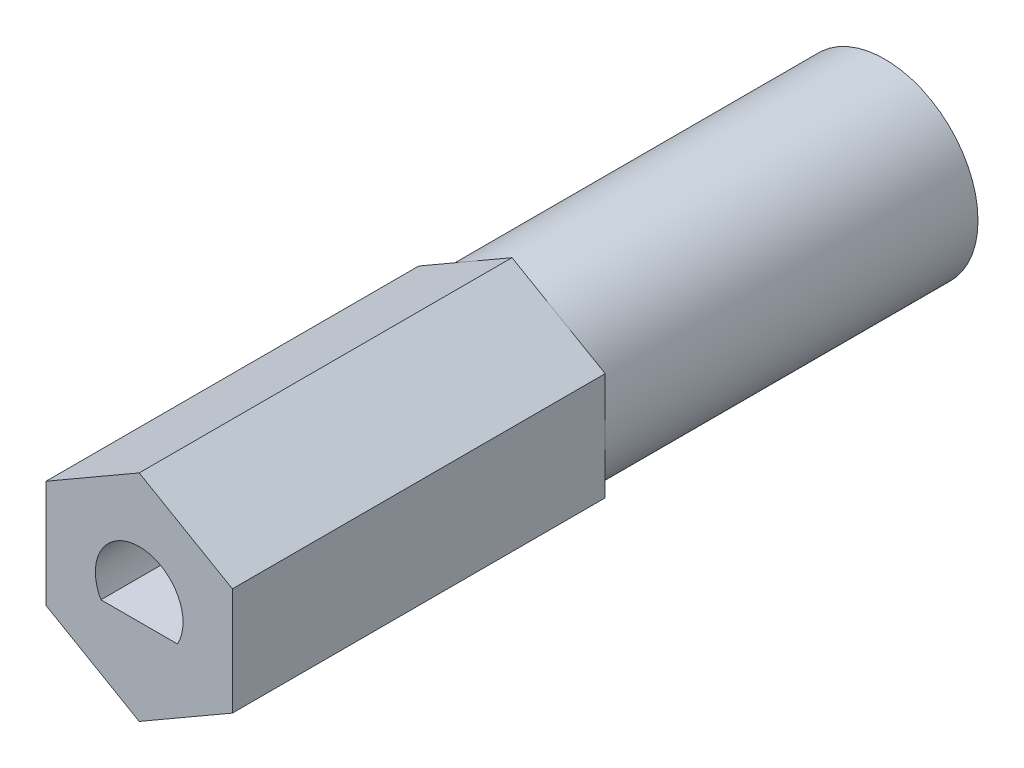
ISO-10303-21;
HEADER;
FILE_DESCRIPTION(('STEP AP214'),'2;1');
FILE_NAME('part.step','',(''),(''),'','','');
FILE_SCHEMA(('AUTOMOTIVE_DESIGN { 1 0 10303 214 1 1 1 1 }'));
ENDSEC;
DATA;
#1=APPLICATION_CONTEXT('core data for automotive mechanical design processes');
#2=APPLICATION_PROTOCOL_DEFINITION('international standard','automotive_design',2000,#1);
#3=PRODUCT_CONTEXT('',#1,'mechanical');
#4=PRODUCT('Part','Part','',(#3));
#5=PRODUCT_RELATED_PRODUCT_CATEGORY('part','',(#4));
#6=PRODUCT_DEFINITION_FORMATION('','',#4);
#7=PRODUCT_DEFINITION_CONTEXT('part definition',#1,'design');
#8=PRODUCT_DEFINITION('design','',#6,#7);
#9=PRODUCT_DEFINITION_SHAPE('','',#8);
#10=(LENGTH_UNIT() NAMED_UNIT(*) SI_UNIT(.MILLI.,.METRE.));
#11=(NAMED_UNIT(*) PLANE_ANGLE_UNIT() SI_UNIT($,.RADIAN.));
#12=(NAMED_UNIT(*) SI_UNIT($,.STERADIAN.) SOLID_ANGLE_UNIT());
#13=UNCERTAINTY_MEASURE_WITH_UNIT(LENGTH_MEASURE(1.E-05),#10,'distance_accuracy_value','');
#14=(GEOMETRIC_REPRESENTATION_CONTEXT(3) GLOBAL_UNCERTAINTY_ASSIGNED_CONTEXT((#13)) GLOBAL_UNIT_ASSIGNED_CONTEXT((#10,
#11,#12)) REPRESENTATION_CONTEXT('',''));
#15=CARTESIAN_POINT('',(0.,0.,0.));
#16=DIRECTION('',(0.,0.,1.));
#17=DIRECTION('',(1.,0.,0.));
#18=AXIS2_PLACEMENT_3D('',#15,#16,#17);
#19=CARTESIAN_POINT('',(3.175,1.83308710467706,-25.4));
#20=DIRECTION('',(0.5,0.866025403784439,0.));
#21=DIRECTION('',(-0.866025403784439,0.5,0.));
#22=AXIS2_PLACEMENT_3D('',#19,#20,#21);
#23=PLANE('',#22);
#24=DIRECTION('',(0.866025403784439,-0.5,0.));
#25=VECTOR('',#24,1.);
#26=CARTESIAN_POINT('',(3.175,1.83308710467706,-12.7));
#27=LINE('',#26,#25);
#28=CARTESIAN_POINT('',(0.,3.66617420935412,-12.7));
#29=VERTEX_POINT('',#28);
#30=CARTESIAN_POINT('',(1.5875,2.74963065701559,-12.7));
#31=VERTEX_POINT('',#30);
#32=EDGE_CURVE('E150',#29,#31,#27,.T.);
#33=ORIENTED_EDGE('',*,*,#32,.F.);
#34=DIRECTION('',(0.,0.,1.));
#35=VECTOR('',#34,1.);
#36=CARTESIAN_POINT('',(0.,3.66617420935412,-25.4));
#37=LINE('',#36,#35);
#38=CARTESIAN_POINT('',(0.,3.66617420935412,0.));
#39=VERTEX_POINT('',#38);
#40=EDGE_CURVE('E183',#29,#39,#37,.T.);
#41=ORIENTED_EDGE('',*,*,#40,.T.);
#42=DIRECTION('',(-0.866025403784439,0.5,0.));
#43=VECTOR('',#42,1.);
#44=CARTESIAN_POINT('',(3.175,1.83308710467706,0.));
#45=LINE('',#44,#43);
#46=CARTESIAN_POINT('',(3.175,1.83308710467706,0.));
#47=VERTEX_POINT('',#46);
#48=EDGE_CURVE('E164',#47,#39,#45,.T.);
#49=ORIENTED_EDGE('',*,*,#48,.F.);
#50=DIRECTION('',(0.,0.,1.));
#51=VECTOR('',#50,1.);
#52=CARTESIAN_POINT('',(3.175,1.83308710467706,-25.4));
#53=LINE('',#52,#51);
#54=CARTESIAN_POINT('',(3.175,1.83308710467706,-12.7));
#55=VERTEX_POINT('',#54);
#56=EDGE_CURVE('E184',#55,#47,#53,.T.);
#57=ORIENTED_EDGE('',*,*,#56,.F.);
#58=EDGE_CURVE('E121',#31,#55,#27,.T.);
#59=ORIENTED_EDGE('',*,*,#58,.F.);
#60=EDGE_LOOP('',(#33,#41,#49,#57,#59));
#61=FACE_BOUND('',#60,.T.);
#62=ADVANCED_FACE('F33',(#61),#23,.T.);
#63=CARTESIAN_POINT('',(3.175,-1.83308710467706,-25.4));
#64=DIRECTION('',(1.,0.,0.));
#65=DIRECTION('',(0.,1.,0.));
#66=AXIS2_PLACEMENT_3D('',#63,#64,#65);
#67=PLANE('',#66);
#68=DIRECTION('',(0.,-1.,0.));
#69=VECTOR('',#68,1.);
#70=CARTESIAN_POINT('',(3.175,-1.83308710467706,-12.7));
#71=LINE('',#70,#69);
#72=CARTESIAN_POINT('',(3.175,0.,-12.7));
#73=VERTEX_POINT('',#72);
#74=EDGE_CURVE('E115',#55,#73,#71,.T.);
#75=ORIENTED_EDGE('',*,*,#74,.F.);
#76=ORIENTED_EDGE('',*,*,#56,.T.);
#77=DIRECTION('',(0.,1.,0.));
#78=VECTOR('',#77,1.);
#79=CARTESIAN_POINT('',(3.175,-1.83308710467706,0.));
#80=LINE('',#79,#78);
#81=CARTESIAN_POINT('',(3.175,-1.83308710467706,0.));
#82=VERTEX_POINT('',#81);
#83=EDGE_CURVE('E180',#82,#47,#80,.T.);
#84=ORIENTED_EDGE('',*,*,#83,.F.);
#85=DIRECTION('',(0.,0.,1.));
#86=VECTOR('',#85,1.);
#87=CARTESIAN_POINT('',(3.175,-1.83308710467706,-25.4));
#88=LINE('',#87,#86);
#89=CARTESIAN_POINT('',(3.175,-1.83308710467706,-12.7));
#90=VERTEX_POINT('',#89);
#91=EDGE_CURVE('E144',#90,#82,#88,.T.);
#92=ORIENTED_EDGE('',*,*,#91,.F.);
#93=EDGE_CURVE('E125',#73,#90,#71,.T.);
#94=ORIENTED_EDGE('',*,*,#93,.F.);
#95=EDGE_LOOP('',(#75,#76,#84,#92,#94));
#96=FACE_BOUND('',#95,.T.);
#97=ADVANCED_FACE('F142',(#96),#67,.T.);
#98=CARTESIAN_POINT('',(0.,-3.66617420935412,-25.4));
#99=DIRECTION('',(0.5,-0.866025403784438,0.));
#100=DIRECTION('',(0.866025403784439,0.5,0.));
#101=AXIS2_PLACEMENT_3D('',#98,#99,#100);
#102=PLANE('',#101);
#103=DIRECTION('',(-0.866025403784439,-0.5,0.));
#104=VECTOR('',#103,1.);
#105=CARTESIAN_POINT('',(0.,-3.66617420935412,-12.7));
#106=LINE('',#105,#104);
#107=CARTESIAN_POINT('',(1.5875,-2.74963065701559,-12.7));
#108=VERTEX_POINT('',#107);
#109=EDGE_CURVE('E132',#90,#108,#106,.T.);
#110=ORIENTED_EDGE('',*,*,#109,.F.);
#111=ORIENTED_EDGE('',*,*,#91,.T.);
#112=DIRECTION('',(0.866025403784439,0.5,0.));
#113=VECTOR('',#112,1.);
#114=CARTESIAN_POINT('',(0.,-3.66617420935412,0.));
#115=LINE('',#114,#113);
#116=CARTESIAN_POINT('',(0.,-3.66617420935412,0.));
#117=VERTEX_POINT('',#116);
#118=EDGE_CURVE('E177',#117,#82,#115,.T.);
#119=ORIENTED_EDGE('',*,*,#118,.F.);
#120=DIRECTION('',(0.,0.,1.));
#121=VECTOR('',#120,1.);
#122=CARTESIAN_POINT('',(0.,-3.66617420935412,-25.4));
#123=LINE('',#122,#121);
#124=CARTESIAN_POINT('',(0.,-3.66617420935412,-12.7));
#125=VERTEX_POINT('',#124);
#126=EDGE_CURVE('E188',#125,#117,#123,.T.);
#127=ORIENTED_EDGE('',*,*,#126,.F.);
#128=EDGE_CURVE('E145',#108,#125,#106,.T.);
#129=ORIENTED_EDGE('',*,*,#128,.F.);
#130=EDGE_LOOP('',(#110,#111,#119,#127,#129));
#131=FACE_BOUND('',#130,.T.);
#132=ADVANCED_FACE('F214',(#131),#102,.T.);
#133=CARTESIAN_POINT('',(-3.175,-1.83308710467706,-25.4));
#134=DIRECTION('',(-0.5,-0.866025403784439,0.));
#135=DIRECTION('',(0.866025403784439,-0.5,0.));
#136=AXIS2_PLACEMENT_3D('',#133,#134,#135);
#137=PLANE('',#136);
#138=DIRECTION('',(-0.866025403784439,0.5,0.));
#139=VECTOR('',#138,1.);
#140=CARTESIAN_POINT('',(-3.175,-1.83308710467706,-12.7));
#141=LINE('',#140,#139);
#142=CARTESIAN_POINT('',(-1.5875,-2.74963065701559,-12.7));
#143=VERTEX_POINT('',#142);
#144=EDGE_CURVE('E218',#125,#143,#141,.T.);
#145=ORIENTED_EDGE('',*,*,#144,.F.);
#146=ORIENTED_EDGE('',*,*,#126,.T.);
#147=DIRECTION('',(0.866025403784439,-0.5,0.));
#148=VECTOR('',#147,1.);
#149=CARTESIAN_POINT('',(-3.175,-1.83308710467706,0.));
#150=LINE('',#149,#148);
#151=CARTESIAN_POINT('',(-3.175,-1.83308710467706,0.));
#152=VERTEX_POINT('',#151);
#153=EDGE_CURVE('E174',#152,#117,#150,.T.);
#154=ORIENTED_EDGE('',*,*,#153,.F.);
#155=DIRECTION('',(0.,0.,1.));
#156=VECTOR('',#155,1.);
#157=CARTESIAN_POINT('',(-3.175,-1.83308710467706,-25.4));
#158=LINE('',#157,#156);
#159=CARTESIAN_POINT('',(-3.175,-1.83308710467706,-12.7));
#160=VERTEX_POINT('',#159);
#161=EDGE_CURVE('E190',#160,#152,#158,.T.);
#162=ORIENTED_EDGE('',*,*,#161,.F.);
#163=EDGE_CURVE('E219',#143,#160,#141,.T.);
#164=ORIENTED_EDGE('',*,*,#163,.F.);
#165=EDGE_LOOP('',(#145,#146,#154,#162,#164));
#166=FACE_BOUND('',#165,.T.);
#167=ADVANCED_FACE('F238',(#166),#137,.T.);
#168=CARTESIAN_POINT('',(-3.175,1.83308710467706,-25.4));
#169=DIRECTION('',(-1.,0.,0.));
#170=DIRECTION('',(0.,-1.,0.));
#171=AXIS2_PLACEMENT_3D('',#168,#169,#170);
#172=PLANE('',#171);
#173=DIRECTION('',(0.,1.,0.));
#174=VECTOR('',#173,1.);
#175=CARTESIAN_POINT('',(-3.175,1.83308710467706,-12.7));
#176=LINE('',#175,#174);
#177=CARTESIAN_POINT('',(-3.175,0.,-12.7));
#178=VERTEX_POINT('',#177);
#179=EDGE_CURVE('E220',#160,#178,#176,.T.);
#180=ORIENTED_EDGE('',*,*,#179,.F.);
#181=ORIENTED_EDGE('',*,*,#161,.T.);
#182=DIRECTION('',(0.,-1.,0.));
#183=VECTOR('',#182,1.);
#184=CARTESIAN_POINT('',(-3.175,1.83308710467706,0.));
#185=LINE('',#184,#183);
#186=CARTESIAN_POINT('',(-3.175,1.83308710467706,0.));
#187=VERTEX_POINT('',#186);
#188=EDGE_CURVE('E171',#187,#152,#185,.T.);
#189=ORIENTED_EDGE('',*,*,#188,.F.);
#190=DIRECTION('',(0.,0.,1.));
#191=VECTOR('',#190,1.);
#192=CARTESIAN_POINT('',(-3.175,1.83308710467706,-25.4));
#193=LINE('',#192,#191);
#194=CARTESIAN_POINT('',(-3.175,1.83308710467706,-12.7));
#195=VERTEX_POINT('',#194);
#196=EDGE_CURVE('E192',#195,#187,#193,.T.);
#197=ORIENTED_EDGE('',*,*,#196,.F.);
#198=EDGE_CURVE('E140',#178,#195,#176,.T.);
#199=ORIENTED_EDGE('',*,*,#198,.F.);
#200=EDGE_LOOP('',(#180,#181,#189,#197,#199));
#201=FACE_BOUND('',#200,.T.);
#202=ADVANCED_FACE('F236',(#201),#172,.T.);
#203=CARTESIAN_POINT('',(0.,3.66617420935412,-25.4));
#204=DIRECTION('',(-0.5,0.866025403784439,0.));
#205=DIRECTION('',(-0.866025403784439,-0.5,0.));
#206=AXIS2_PLACEMENT_3D('',#203,#204,#205);
#207=PLANE('',#206);
#208=DIRECTION('',(0.866025403784439,0.5,0.));
#209=VECTOR('',#208,1.);
#210=CARTESIAN_POINT('',(0.,3.66617420935412,-12.7));
#211=LINE('',#210,#209);
#212=CARTESIAN_POINT('',(-1.5875,2.74963065701559,-12.7));
#213=VERTEX_POINT('',#212);
#214=EDGE_CURVE('E12',#195,#213,#211,.T.);
#215=ORIENTED_EDGE('',*,*,#214,.F.);
#216=ORIENTED_EDGE('',*,*,#196,.T.);
#217=DIRECTION('',(-0.866025403784439,-0.5,0.));
#218=VECTOR('',#217,1.);
#219=CARTESIAN_POINT('',(0.,3.66617420935412,0.));
#220=LINE('',#219,#218);
#221=EDGE_CURVE('E168',#39,#187,#220,.T.);
#222=ORIENTED_EDGE('',*,*,#221,.F.);
#223=ORIENTED_EDGE('',*,*,#40,.F.);
#224=EDGE_CURVE('E36',#213,#29,#211,.T.);
#225=ORIENTED_EDGE('',*,*,#224,.F.);
#226=EDGE_LOOP('',(#215,#216,#222,#223,#225));
#227=FACE_BOUND('',#226,.T.);
#228=ADVANCED_FACE('F205',(#227),#207,.T.);
#229=CARTESIAN_POINT('',(0.,0.,0.));
#230=DIRECTION('',(0.,0.,1.));
#231=DIRECTION('',(1.,0.,0.));
#232=AXIS2_PLACEMENT_3D('',#229,#230,#231);
#233=PLANE('',#232);
#234=CARTESIAN_POINT('',(0.,0.,0.));
#235=DIRECTION('',(0.,0.,1.));
#236=DIRECTION('',(1.,0.,0.));
#237=AXIS2_PLACEMENT_3D('',#234,#235,#236);
#238=CIRCLE('',#237,1.49352);
#239=CARTESIAN_POINT('',(1.30352988074689,-0.72898,0.));
#240=VERTEX_POINT('',#239);
#241=CARTESIAN_POINT('',(-1.30352988074689,-0.72898,0.));
#242=VERTEX_POINT('',#241);
#243=EDGE_CURVE('E55',#240,#242,#238,.T.);
#244=ORIENTED_EDGE('',*,*,#243,.F.);
#245=DIRECTION('',(1.,0.,0.));
#246=VECTOR('',#245,1.);
#247=CARTESIAN_POINT('',(-1.30352988074689,-0.72898,0.));
#248=LINE('',#247,#246);
#249=EDGE_CURVE('E155',#242,#240,#248,.T.);
#250=ORIENTED_EDGE('',*,*,#249,.F.);
#251=EDGE_LOOP('',(#244,#250));
#252=FACE_BOUND('',#251,.T.);
#253=ORIENTED_EDGE('',*,*,#48,.T.);
#254=ORIENTED_EDGE('',*,*,#221,.T.);
#255=ORIENTED_EDGE('',*,*,#188,.T.);
#256=ORIENTED_EDGE('',*,*,#153,.T.);
#257=ORIENTED_EDGE('',*,*,#118,.T.);
#258=ORIENTED_EDGE('',*,*,#83,.T.);
#259=EDGE_LOOP('',(#253,#254,#255,#256,#257,#258));
#260=FACE_BOUND('',#259,.T.);
#261=ADVANCED_FACE('F209',(#252,#260),#233,.T.);
#262=CARTESIAN_POINT('',(0.,0.,-5.08));
#263=DIRECTION('',(0.,0.,1.));
#264=DIRECTION('',(1.,0.,0.));
#265=AXIS2_PLACEMENT_3D('',#262,#263,#264);
#266=CYLINDRICAL_SURFACE('',#265,1.49352);
#267=ORIENTED_EDGE('',*,*,#243,.T.);
#268=DIRECTION('',(0.,0.,1.));
#269=VECTOR('',#268,1.);
#270=CARTESIAN_POINT('',(-1.30352988074689,-0.72898,-5.08));
#271=LINE('',#270,#269);
#272=CARTESIAN_POINT('',(-1.30352988074689,-0.72898,-5.08));
#273=VERTEX_POINT('',#272);
#274=EDGE_CURVE('E158',#273,#242,#271,.T.);
#275=ORIENTED_EDGE('',*,*,#274,.F.);
#276=CARTESIAN_POINT('',(0.,0.,-5.08));
#277=DIRECTION('',(0.,0.,1.));
#278=DIRECTION('',(1.,0.,0.));
#279=AXIS2_PLACEMENT_3D('',#276,#277,#278);
#280=CIRCLE('',#279,1.49352);
#281=CARTESIAN_POINT('',(1.30352988074689,-0.72898,-5.08));
#282=VERTEX_POINT('',#281);
#283=EDGE_CURVE('E151',#282,#273,#280,.T.);
#284=ORIENTED_EDGE('',*,*,#283,.F.);
#285=DIRECTION('',(0.,0.,1.));
#286=VECTOR('',#285,1.);
#287=CARTESIAN_POINT('',(1.30352988074689,-0.72898,-5.08));
#288=LINE('',#287,#286);
#289=EDGE_CURVE('E162',#282,#240,#288,.T.);
#290=ORIENTED_EDGE('',*,*,#289,.T.);
#291=EDGE_LOOP('',(#267,#275,#284,#290));
#292=FACE_BOUND('',#291,.T.);
#293=ADVANCED_FACE('F257',(#292),#266,.F.);
#294=CARTESIAN_POINT('',(-1.30352988074689,-0.72898,-5.08));
#295=DIRECTION('',(0.,-1.,0.));
#296=DIRECTION('',(0.,0.,-1.));
#297=AXIS2_PLACEMENT_3D('',#294,#295,#296);
#298=PLANE('',#297);
#299=ORIENTED_EDGE('',*,*,#249,.T.);
#300=ORIENTED_EDGE('',*,*,#289,.F.);
#301=DIRECTION('',(1.,0.,0.));
#302=VECTOR('',#301,1.);
#303=CARTESIAN_POINT('',(-1.30352988074689,-0.72898,-5.08));
#304=LINE('',#303,#302);
#305=EDGE_CURVE('E154',#273,#282,#304,.T.);
#306=ORIENTED_EDGE('',*,*,#305,.F.);
#307=ORIENTED_EDGE('',*,*,#274,.T.);
#308=EDGE_LOOP('',(#299,#300,#306,#307));
#309=FACE_BOUND('',#308,.T.);
#310=ADVANCED_FACE('F265',(#309),#298,.F.);
#311=CARTESIAN_POINT('',(0.,0.,-5.08));
#312=DIRECTION('',(0.,0.,1.));
#313=DIRECTION('',(1.,0.,0.));
#314=AXIS2_PLACEMENT_3D('',#311,#312,#313);
#315=PLANE('',#314);
#316=ORIENTED_EDGE('',*,*,#283,.T.);
#317=ORIENTED_EDGE('',*,*,#305,.T.);
#318=EDGE_LOOP('',(#316,#317));
#319=FACE_BOUND('',#318,.T.);
#320=ADVANCED_FACE('F268',(#319),#315,.T.);
#321=CARTESIAN_POINT('',(0.,0.,-12.7));
#322=DIRECTION('',(0.,0.,1.));
#323=DIRECTION('',(1.,0.,0.));
#324=AXIS2_PLACEMENT_3D('',#321,#322,#323);
#325=PLANE('',#324);
#326=ORIENTED_EDGE('',*,*,#32,.T.);
#327=CARTESIAN_POINT('',(0.,0.,-12.7));
#328=DIRECTION('',(0.,0.,1.));
#329=DIRECTION('',(1.,0.,0.));
#330=AXIS2_PLACEMENT_3D('',#327,#328,#329);
#331=CIRCLE('',#330,3.175);
#332=EDGE_CURVE('E47',#31,#213,#331,.T.);
#333=ORIENTED_EDGE('',*,*,#332,.T.);
#334=ORIENTED_EDGE('',*,*,#224,.T.);
#335=EDGE_LOOP('',(#326,#333,#334));
#336=FACE_BOUND('',#335,.T.);
#337=ADVANCED_FACE('F198',(#336),#325,.F.);
#338=ORIENTED_EDGE('',*,*,#58,.T.);
#339=ORIENTED_EDGE('',*,*,#74,.T.);
#340=EDGE_CURVE('E119',#73,#31,#331,.T.);
#341=ORIENTED_EDGE('',*,*,#340,.T.);
#342=EDGE_LOOP('',(#338,#339,#341));
#343=FACE_BOUND('',#342,.T.);
#344=ADVANCED_FACE('F117',(#343),#325,.F.);
#345=ORIENTED_EDGE('',*,*,#93,.T.);
#346=ORIENTED_EDGE('',*,*,#109,.T.);
#347=EDGE_CURVE('E129',#108,#73,#331,.T.);
#348=ORIENTED_EDGE('',*,*,#347,.T.);
#349=EDGE_LOOP('',(#345,#346,#348));
#350=FACE_BOUND('',#349,.T.);
#351=ADVANCED_FACE('F130',(#350),#325,.F.);
#352=ORIENTED_EDGE('',*,*,#128,.T.);
#353=ORIENTED_EDGE('',*,*,#144,.T.);
#354=EDGE_CURVE('E136',#143,#108,#331,.T.);
#355=ORIENTED_EDGE('',*,*,#354,.T.);
#356=EDGE_LOOP('',(#352,#353,#355));
#357=FACE_BOUND('',#356,.T.);
#358=ADVANCED_FACE('F279',(#357),#325,.F.);
#359=ORIENTED_EDGE('',*,*,#163,.T.);
#360=ORIENTED_EDGE('',*,*,#179,.T.);
#361=EDGE_CURVE('E230',#178,#143,#331,.T.);
#362=ORIENTED_EDGE('',*,*,#361,.T.);
#363=EDGE_LOOP('',(#359,#360,#362));
#364=FACE_BOUND('',#363,.T.);
#365=ADVANCED_FACE('F229',(#364),#325,.F.);
#366=CARTESIAN_POINT('',(0.,0.,-25.4));
#367=DIRECTION('',(0.,0.,1.));
#368=DIRECTION('',(1.,0.,0.));
#369=AXIS2_PLACEMENT_3D('',#366,#367,#368);
#370=CYLINDRICAL_SURFACE('',#369,3.175);
#371=ORIENTED_EDGE('',*,*,#332,.F.);
#372=ORIENTED_EDGE('',*,*,#340,.F.);
#373=ORIENTED_EDGE('',*,*,#347,.F.);
#374=ORIENTED_EDGE('',*,*,#354,.F.);
#375=ORIENTED_EDGE('',*,*,#361,.F.);
#376=EDGE_CURVE('E234',#213,#178,#331,.T.);
#377=ORIENTED_EDGE('',*,*,#376,.F.);
#378=EDGE_LOOP('',(#371,#372,#373,#374,#375,#377));
#379=FACE_BOUND('',#378,.T.);
#380=CARTESIAN_POINT('',(0.,0.,-25.4));
#381=DIRECTION('',(0.,0.,1.));
#382=DIRECTION('',(1.,0.,0.));
#383=AXIS2_PLACEMENT_3D('',#380,#381,#382);
#384=CIRCLE('',#383,3.175);
#385=CARTESIAN_POINT('',(3.175,0.,-25.4));
#386=VERTEX_POINT('',#385);
#387=EDGE_CURVE('E186',#386,#386,#384,.T.);
#388=ORIENTED_EDGE('',*,*,#387,.T.);
#389=EDGE_LOOP('',(#388));
#390=FACE_BOUND('',#389,.T.);
#391=ADVANCED_FACE('F138',(#379,#390),#370,.T.);
#392=ORIENTED_EDGE('',*,*,#198,.T.);
#393=ORIENTED_EDGE('',*,*,#214,.T.);
#394=ORIENTED_EDGE('',*,*,#376,.T.);
#395=EDGE_LOOP('',(#392,#393,#394));
#396=FACE_BOUND('',#395,.T.);
#397=ADVANCED_FACE('F235',(#396),#325,.F.);
#398=CARTESIAN_POINT('',(0.,0.,-25.4));
#399=DIRECTION('',(0.,0.,1.));
#400=DIRECTION('',(1.,0.,0.));
#401=AXIS2_PLACEMENT_3D('',#398,#399,#400);
#402=PLANE('',#401);
#403=ORIENTED_EDGE('',*,*,#387,.F.);
#404=EDGE_LOOP('',(#403));
#405=FACE_BOUND('',#404,.T.);
#406=ADVANCED_FACE('F259',(#405),#402,.F.);
#407=CLOSED_SHELL('',(#62,#97,#132,#167,#202,#228,#261,#293,#310,#320,#337,#344,#351,#358,#365,
#391,#397,#406));
#408=MANIFOLD_SOLID_BREP('B2',#407);
#409=ADVANCED_BREP_SHAPE_REPRESENTATION('',(#18,#408),#14);
#410=SHAPE_DEFINITION_REPRESENTATION(#9,#409);
ENDSEC;
END-ISO-10303-21;
